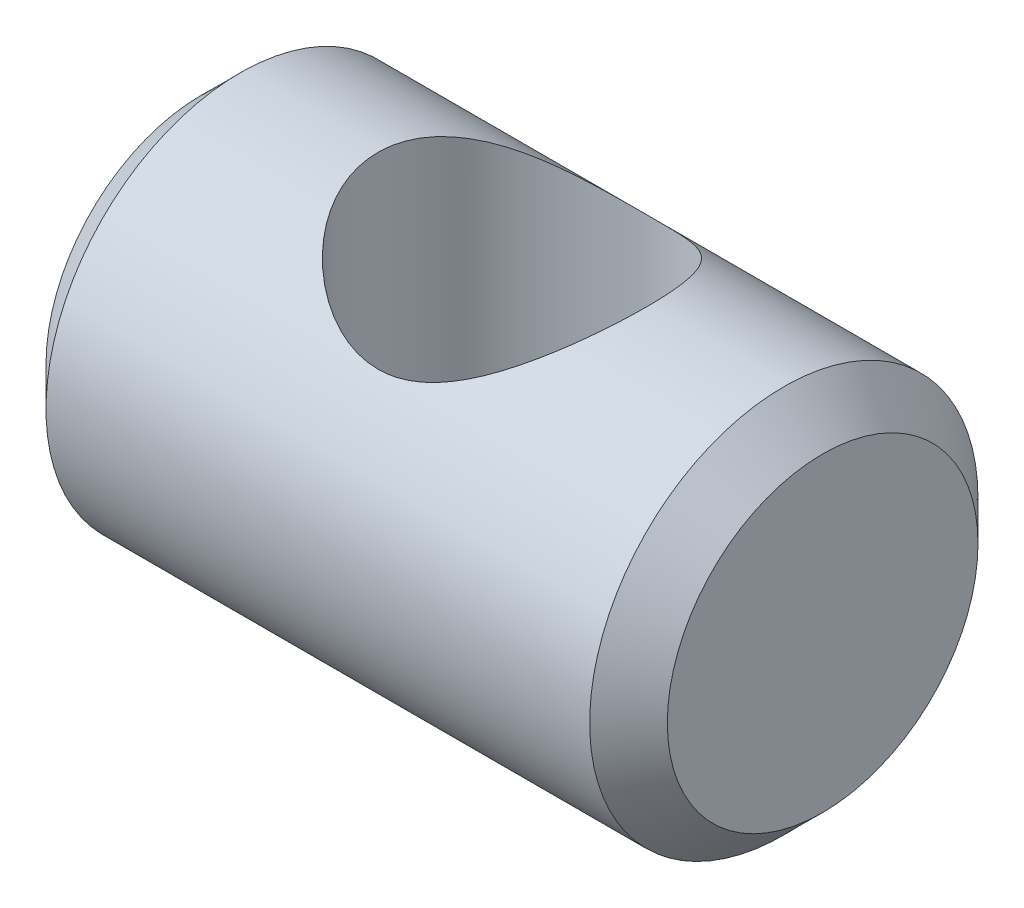
ISO-10303-21;
HEADER;
FILE_DESCRIPTION(('STEP AP214'),'2;1');
FILE_NAME('part.step','',(''),(''),'','','');
FILE_SCHEMA(('AUTOMOTIVE_DESIGN { 1 0 10303 214 1 1 1 1 }'));
ENDSEC;
DATA;
#1=APPLICATION_CONTEXT('core data for automotive mechanical design processes');
#2=APPLICATION_PROTOCOL_DEFINITION('international standard','automotive_design',2000,#1);
#3=PRODUCT_CONTEXT('',#1,'mechanical');
#4=PRODUCT('Part','Part','',(#3));
#5=PRODUCT_RELATED_PRODUCT_CATEGORY('part','',(#4));
#6=PRODUCT_DEFINITION_FORMATION('','',#4);
#7=PRODUCT_DEFINITION_CONTEXT('part definition',#1,'design');
#8=PRODUCT_DEFINITION('design','',#6,#7);
#9=PRODUCT_DEFINITION_SHAPE('','',#8);
#10=(LENGTH_UNIT() NAMED_UNIT(*) SI_UNIT(.MILLI.,.METRE.));
#11=(NAMED_UNIT(*) PLANE_ANGLE_UNIT() SI_UNIT($,.RADIAN.));
#12=(NAMED_UNIT(*) SI_UNIT($,.STERADIAN.) SOLID_ANGLE_UNIT());
#13=UNCERTAINTY_MEASURE_WITH_UNIT(LENGTH_MEASURE(1.E-05),#10,'distance_accuracy_value','');
#14=(GEOMETRIC_REPRESENTATION_CONTEXT(3) GLOBAL_UNCERTAINTY_ASSIGNED_CONTEXT((#13)) GLOBAL_UNIT_ASSIGNED_CONTEXT((#10,
#11,#12)) REPRESENTATION_CONTEXT('',''));
#15=CARTESIAN_POINT('',(0.,0.,0.));
#16=DIRECTION('',(0.,0.,1.));
#17=DIRECTION('',(1.,0.,0.));
#18=AXIS2_PLACEMENT_3D('',#15,#16,#17);
#19=CARTESIAN_POINT('',(16.,0.,0.));
#20=DIRECTION('',(-1.,0.,0.));
#21=DIRECTION('',(0.,0.,1.));
#22=AXIS2_PLACEMENT_3D('',#19,#20,#21);
#23=CYLINDRICAL_SURFACE('',#22,5.);
#24=CARTESIAN_POINT('',(15.,0.,0.));
#25=DIRECTION('',(1.,0.,0.));
#26=DIRECTION('',(0.,0.,-1.));
#27=AXIS2_PLACEMENT_3D('',#24,#25,#26);
#28=CIRCLE('',#27,5.);
#29=CARTESIAN_POINT('',(15.,0.,-5.));
#30=VERTEX_POINT('',#29);
#31=EDGE_CURVE('E37',#30,#30,#28,.F.);
#32=ORIENTED_EDGE('',*,*,#31,.T.);
#33=EDGE_LOOP('',(#32));
#34=FACE_BOUND('',#33,.T.);
#35=CARTESIAN_POINT('',(1.,0.,0.));
#36=DIRECTION('',(1.,0.,0.));
#37=DIRECTION('',(0.,0.,-1.));
#38=AXIS2_PLACEMENT_3D('',#35,#36,#37);
#39=CIRCLE('',#38,5.);
#40=CARTESIAN_POINT('',(1.,0.,-5.));
#41=VERTEX_POINT('',#40);
#42=EDGE_CURVE('E41',#41,#41,#39,.T.);
#43=ORIENTED_EDGE('',*,*,#42,.T.);
#44=EDGE_LOOP('',(#43));
#45=FACE_BOUND('',#44,.T.);
#46=CARTESIAN_POINT('',(4.54682791888593,-5.,0.));
#47=CARTESIAN_POINT('',(4.54682910075321,-4.99999918173203,0.172196156763363));
#48=CARTESIAN_POINT('',(4.55978100499834,-4.99102800434398,0.344395773395106));
#49=CARTESIAN_POINT('',(4.61075983223032,-4.95602798109568,0.68326042610615));
#50=CARTESIAN_POINT('',(4.64879831983937,-4.92999126825687,0.849922872377932));
#51=CARTESIAN_POINT('',(4.74754806789461,-4.86340708269305,1.17229101759618));
#52=CARTESIAN_POINT('',(4.808149374581,-4.82293002042624,1.32804556974799));
#53=CARTESIAN_POINT('',(4.94937572106752,-4.73065063001291,1.62645891734977));
#54=CARTESIAN_POINT('',(5.03000349860223,-4.67884675354127,1.76911591863361));
#55=CARTESIAN_POINT('',(5.21659138432099,-4.56258393251878,2.05137144263456));
#56=CARTESIAN_POINT('',(5.3241498043908,-4.49741460037626,2.18961252705359));
#57=CARTESIAN_POINT('',(5.55766675039381,-4.362507069895,2.44738952544475));
#58=CARTESIAN_POINT('',(5.68365252315353,-4.29276219182179,2.56689718835483));
#59=CARTESIAN_POINT('',(5.89656564603979,-4.18276590630911,2.74048294845699));
#60=CARTESIAN_POINT('',(5.97806259741498,-4.14226128170108,2.80116208806396));
#61=CARTESIAN_POINT('',(6.14655740095954,-4.06267506585551,2.91539452746007));
#62=CARTESIAN_POINT('',(6.23355662296743,-4.02359383283037,2.96894604238101));
#63=CARTESIAN_POINT('',(6.50233684993619,-3.91052346803921,3.11821884468568));
#64=CARTESIAN_POINT('',(6.69232694472034,-3.84047452644748,3.20290853298079));
#65=CARTESIAN_POINT('',(7.02988969071285,-3.74156128666144,3.31732275869861));
#66=CARTESIAN_POINT('',(7.17270531043151,-3.70665241177153,3.35593432460569));
#67=CARTESIAN_POINT('',(7.46489688766408,-3.65259603164848,3.41469801232633));
#68=CARTESIAN_POINT('',(7.61425991736806,-3.63341882113983,3.43488493258815));
#69=CARTESIAN_POINT('',(7.91641624346604,-3.61383411616895,3.45549424599109));
#70=CARTESIAN_POINT('',(8.06922336091824,-3.61352496987331,3.45581307861028));
#71=CARTESIAN_POINT('',(8.37242610912296,-3.63198843395806,3.4363952377521));
#72=CARTESIAN_POINT('',(8.5228199519425,-3.65077458344742,3.41664433426286));
#73=CARTESIAN_POINT('',(8.80808441498534,-3.70270455334308,3.36025439654469));
#74=CARTESIAN_POINT('',(8.94334631702183,-3.73492815822436,3.32468946423209));
#75=CARTESIAN_POINT('',(9.20601296782771,-3.80974914481309,3.2386819553798));
#76=CARTESIAN_POINT('',(9.33341143209238,-3.85235469265914,3.18822766066863));
#77=CARTESIAN_POINT('',(9.64228527811696,-3.96772920020722,3.04456027323595));
#78=CARTESIAN_POINT('',(9.81814384433062,-4.044789322983,2.94267022748984));
#79=CARTESIAN_POINT('',(10.1483447489459,-4.20357063829562,2.71105051300113));
#80=CARTESIAN_POINT('',(10.302644106179,-4.28530069675294,2.5812665047087));
#81=CARTESIAN_POINT('',(10.5889379099589,-4.4456777450186,2.29418410838496));
#82=CARTESIAN_POINT('',(10.720687157563,-4.52428447886163,2.1366169796621));
#83=CARTESIAN_POINT('',(10.955952052221,-4.66955274733486,1.79700191774292));
#84=CARTESIAN_POINT('',(11.0595262415596,-4.73623895004106,1.61500593718904));
#85=CARTESIAN_POINT('',(11.2141846574899,-4.83776906567046,1.2729562406956));
#86=CARTESIAN_POINT('',(11.271815159077,-4.87639473281822,1.11698331299041));
#87=CARTESIAN_POINT('',(11.364413143489,-4.93899809765687,0.795623202532488));
#88=CARTESIAN_POINT('',(11.3993960195488,-4.96298574394239,0.63024249744415));
#89=CARTESIAN_POINT('',(11.444837263291,-4.99421966305794,0.293911581629637));
#90=CARTESIAN_POINT('',(11.4552042398488,-5.00140354731808,0.12294299772574));
#91=CARTESIAN_POINT('',(11.450479145441,-4.99814010880797,-0.218476600652292));
#92=CARTESIAN_POINT('',(11.4353870151718,-4.987692744968,-0.388927613919888));
#93=CARTESIAN_POINT('',(11.3823442556729,-4.95131460901015,-0.713899211129431));
#94=CARTESIAN_POINT('',(11.3458058465487,-4.92634121043672,-0.868764443819995));
#95=CARTESIAN_POINT('',(11.2528643880156,-4.86369756264659,-1.16965181165549));
#96=CARTESIAN_POINT('',(11.1964576598131,-4.82602496211675,-1.31567230324688));
#97=CARTESIAN_POINT('',(11.0610158444308,-4.73736199680481,-1.60695565285634));
#98=CARTESIAN_POINT('',(10.9805922110018,-4.68557999877782,-1.75132630627568));
#99=CARTESIAN_POINT('',(10.8018312404334,-4.57394651645061,-2.02506996094344));
#100=CARTESIAN_POINT('',(10.7034815076101,-4.51408945582995,-2.15443248231643));
#101=CARTESIAN_POINT('',(10.4728682535481,-4.37954752405462,-2.4176292036336));
#102=CARTESIAN_POINT('',(10.3376818696958,-4.30406990980382,-2.54849852636715));
#103=CARTESIAN_POINT('',(10.0476429784116,-4.15367708917197,-2.78690358547467));
#104=CARTESIAN_POINT('',(9.89277820388263,-4.07876226474206,-2.89442465279582));
#105=CARTESIAN_POINT('',(9.58406686339841,-3.9456102896562,-3.07295651612266));
#106=CARTESIAN_POINT('',(9.43225290109357,-3.8864481871076,-3.14677727569369));
#107=CARTESIAN_POINT('',(9.11557716679436,-3.78126645263767,-3.27242454966351));
#108=CARTESIAN_POINT('',(8.95074181776842,-3.7352210370572,-3.32429431234346));
#109=CARTESIAN_POINT('',(8.6421679208131,-3.67010269185821,-3.3959188314815));
#110=CARTESIAN_POINT('',(8.50013126981503,-3.64762496769666,-3.41982764767191));
#111=CARTESIAN_POINT('',(8.21259033523534,-3.61945024972117,-3.44964232562668));
#112=CARTESIAN_POINT('',(8.06709005137103,-3.61373476474713,-3.45556802560528));
#113=CARTESIAN_POINT('',(7.7768615859174,-3.61998913038536,-3.44901296118591));
#114=CARTESIAN_POINT('',(7.63213367572215,-3.63196483316938,-3.43652610599332));
#115=CARTESIAN_POINT('',(7.34743885431317,-3.671711108667,-3.39401689131554));
#116=CARTESIAN_POINT('',(7.20747911724666,-3.69950445655522,-3.36396924508931));
#117=CARTESIAN_POINT('',(6.8940263684569,-3.77746578569453,-3.2764474920316));
#118=CARTESIAN_POINT('',(6.72315074489304,-3.83185379433592,-3.21343478869826));
#119=CARTESIAN_POINT('',(6.39673440636893,-3.95258397909083,-3.0637085483484));
#120=CARTESIAN_POINT('',(6.24121766601841,-4.01894440115507,-2.976958730255));
#121=CARTESIAN_POINT('',(5.9433916911072,-4.1578281301539,-2.77981111505691));
#122=CARTESIAN_POINT('',(5.80145269670578,-4.23045561018461,-2.66893070413724));
#123=CARTESIAN_POINT('',(5.53597770124776,-4.37430851302554,-2.42597207923423));
#124=CARTESIAN_POINT('',(5.41244768168111,-4.44553347363009,-2.29388700421073));
#125=CARTESIAN_POINT('',(5.23386917843982,-4.55240155427666,-2.06977124704514));
#126=CARTESIAN_POINT('',(5.1718894438513,-4.59039728850961,-1.98429835082973));
#127=CARTESIAN_POINT('',(5.05547329358905,-4.66302106813397,-1.80704029505651));
#128=CARTESIAN_POINT('',(5.00103333702178,-4.69765069205234,-1.71525812902221));
#129=CARTESIAN_POINT('',(4.90040623644659,-4.76252106040801,-1.52590685251927));
#130=CARTESIAN_POINT('',(4.85421105176081,-4.7927660754502,-1.42834350521688));
#131=CARTESIAN_POINT('',(4.77076140614659,-4.84794896402373,-1.22808520925869));
#132=CARTESIAN_POINT('',(4.73350361926001,-4.8728888114247,-1.12539218680046));
#133=CARTESIAN_POINT('',(4.65069511903616,-4.92869476707882,-0.857632329920141));
#134=CARTESIAN_POINT('',(4.61193556944714,-4.9552221998418,-0.689451392223377));
#135=CARTESIAN_POINT('',(4.56001218356368,-4.99086787634293,-0.347511585256502));
#136=CARTESIAN_POINT('',(4.546826726302,-5.00000082568765,-0.173757554077207));
#137=CARTESIAN_POINT('',(4.54682791888593,-5.,0.));
#138=B_SPLINE_CURVE_WITH_KNOTS('',3,(#46,#47,#48,#49,#50,#51,#52,#53,#54,#55,#56,#57,#58,#59,
#60,#61,#62,#63,#64,#65,#66,#67,#68,#69,#70,#71,#72,#73,#74,#75,#76,#77,#78,#79,#80,#81,#82,#83,
#84,#85,#86,#87,#88,#89,#90,#91,#92,#93,#94,#95,#96,#97,#98,#99,#100,#101,#102,#103,#104,#105,
#106,#107,#108,#109,#110,#111,#112,#113,#114,#115,#116,#117,#118,#119,#120,#121,#122,#123,#124,
#125,#126,#127,#128,#129,#130,#131,#132,#133,#134,#135,#136,#137),.UNSPECIFIED.,.T.,.F.,(4,2,2,
2,2,2,2,2,2,2,2,2,2,2,2,2,2,2,2,2,2,2,2,2,2,2,2,2,2,2,2,2,2,2,2,2,2,2,2,2,2,2,2,2,2,4),(0.,
0.515904150983216,1.03204629415389,1.54570539797054,2.05943476064836,2.61807149521183,
3.17754274476324,3.50533179794281,3.83320278078806,4.48716881546518,4.94149267770683,
5.39495667647332,5.8507841166619,6.30693497709684,6.73596062923389,7.16532483616348,
7.81400221678349,8.46395491301902,9.12057887552444,9.77582789535008,10.2858068259602,
10.795438766985,11.3069598733689,11.8184821712765,12.2995956681031,12.7807982941843,
13.2983875888437,13.8163361575892,14.422158628214,15.028360625848,15.5630919786522,
16.0967648323793,16.5322008494351,16.9671563369361,17.4022557381363,17.8379832117704,
18.4051254734002,18.9731394750222,19.5537743623541,20.1345975015913,20.4708141758247,
20.8068724138473,21.1426011000412,21.4782046538526,21.9992274695231,22.5198096073481),.UNSPECIFIED.);
#139=CARTESIAN_POINT('',(4.54682791888593,-5.,0.));
#140=VERTEX_POINT('',#139);
#141=EDGE_CURVE('E50',#140,#140,#138,.T.);
#142=ORIENTED_EDGE('',*,*,#141,.T.);
#143=EDGE_LOOP('',(#142));
#144=FACE_BOUND('',#143,.T.);
#145=CARTESIAN_POINT('',(8.,3.6160202679485,3.45317208111407));
#146=CARTESIAN_POINT('',(7.91668999530245,3.61601110102939,3.45317713537138));
#147=CARTESIAN_POINT('',(7.83341436044414,3.61890880846796,3.4501536815529));
#148=CARTESIAN_POINT('',(7.66765640961408,3.63032154441814,3.43814504215448));
#149=CARTESIAN_POINT('',(7.58517425085987,3.63883766380207,3.42915869881641));
#150=CARTESIAN_POINT('',(7.42164025270491,3.66108204127706,3.40539851331557));
#151=CARTESIAN_POINT('',(7.3405908643512,3.6748184679887,3.39061559965051));
#152=CARTESIAN_POINT('',(7.180598320214,3.70686777138745,3.35554688490185));
#153=CARTESIAN_POINT('',(7.10165631921745,3.72518310243223,3.33525813211023));
#154=CARTESIAN_POINT('',(6.87042209971612,3.7854447496548,3.26711689715834));
#155=CARTESIAN_POINT('',(6.72176135513656,3.83300470488468,3.21169222893622));
#156=CARTESIAN_POINT('',(6.43625356593956,3.93740644786877,3.08280620332772));
#157=CARTESIAN_POINT('',(6.29940789483783,3.99424931255676,3.00934275271808));
#158=CARTESIAN_POINT('',(6.01591553457581,4.12233007111759,2.83201235766588));
#159=CARTESIAN_POINT('',(5.87153587500692,4.19437525314578,2.72510314230678));
#160=CARTESIAN_POINT('',(5.60069571131038,4.33809784369231,2.48996184894861));
#161=CARTESIAN_POINT('',(5.4742566385771,4.40977471539496,2.36170465988116));
#162=CARTESIAN_POINT('',(5.29041521033473,4.51824174888274,2.14325590333096));
#163=CARTESIAN_POINT('',(5.22629075628646,4.55706133551027,2.0596440483324));
#164=CARTESIAN_POINT('',(5.10541455757851,4.63162600092784,1.88598961976921));
#165=CARTESIAN_POINT('',(5.0486595093824,4.66737245488781,1.79594995589417));
#166=CARTESIAN_POINT('',(4.94322453724054,4.73474792384596,1.60994675612301));
#167=CARTESIAN_POINT('',(4.89453450672623,4.76638208124443,1.51399084432569));
#168=CARTESIAN_POINT('',(4.80589007499087,4.82460643720123,1.31672271046611));
#169=CARTESIAN_POINT('',(4.76593200753623,4.85119875202254,1.21541275864404));
#170=CARTESIAN_POINT('',(4.67881318183096,4.90962140079808,0.959180589431557));
#171=CARTESIAN_POINT('',(4.63715354584004,4.93800053542577,0.80152193111207));
#172=CARTESIAN_POINT('',(4.57645372694371,4.97953628392576,0.480064373898841));
#173=CARTESIAN_POINT('',(4.5573957760523,4.99270485514888,0.316270402836387));
#174=CARTESIAN_POINT('',(4.54291365823344,5.00270109985476,-0.0131865530433853));
#175=CARTESIAN_POINT('',(4.54753272043397,4.99949888383311,-0.178852405097388));
#176=CARTESIAN_POINT('',(4.58023633119844,4.97697186107739,-0.506736022372955));
#177=CARTESIAN_POINT('',(4.6083275878099,4.95764244540198,-0.668952788299139));
#178=CARTESIAN_POINT('',(4.68559987515033,4.90510659228885,-0.982165388445185));
#179=CARTESIAN_POINT('',(4.73433008391627,4.87219716041332,-1.13332443683614));
#180=CARTESIAN_POINT('',(4.85065447802043,4.79500685030528,-1.4250278898192));
#181=CARTESIAN_POINT('',(4.91825230295993,4.75072377820628,-1.56557023977566));
#182=CARTESIAN_POINT('',(5.07865424052564,4.64818546659489,-1.84921562721286));
#183=CARTESIAN_POINT('',(5.17343892132361,4.58891865720852,-1.99082685183754));
#184=CARTESIAN_POINT('',(5.38109513441154,4.46400957978206,-2.25705384691499));
#185=CARTESIAN_POINT('',(5.49398681801501,4.39836024105407,-2.38165039229081));
#186=CARTESIAN_POINT('',(5.757100237581,4.25347479839561,-2.63295626256513));
#187=CARTESIAN_POINT('',(5.9103985139408,4.173866724347,-2.75624079671781));
#188=CARTESIAN_POINT('',(6.23761307204616,4.02004717812529,-2.97610383501427));
#189=CARTESIAN_POINT('',(6.41152129956312,3.94583361598661,-3.07269272278503));
#190=CARTESIAN_POINT('',(6.7352926348354,3.82857655459006,-3.21691275151425));
#191=CARTESIAN_POINT('',(6.88122891813934,3.78230483380808,-3.27071317346371));
#192=CARTESIAN_POINT('',(7.18266094672693,3.70441220426919,-3.35869613388319));
#193=CARTESIAN_POINT('',(7.3381382961999,3.67276404698872,-3.39291518751473));
#194=CARTESIAN_POINT('',(7.57644901905259,3.6398709839845,-3.42805727631623));
#195=CARTESIAN_POINT('',(7.65717182951374,3.63133075888234,-3.43707750290734));
#196=CARTESIAN_POINT('',(7.81942541857755,3.61962509180995,-3.44940485459584));
#197=CARTESIAN_POINT('',(7.90095579381123,3.61645709042855,-3.45271470022085));
#198=CARTESIAN_POINT('',(8.06407932977235,3.61566796761627,-3.45354095278969));
#199=CARTESIAN_POINT('',(8.14567249516098,3.61804730791127,-3.45105687748392));
#200=CARTESIAN_POINT('',(8.30811936988585,3.6282163761755,-3.44036261561005));
#201=CARTESIAN_POINT('',(8.38897310276153,3.63600593130177,-3.43215261197112));
#202=CARTESIAN_POINT('',(8.60894710704228,3.66432429843713,-3.40197713159878));
#203=CARTESIAN_POINT('',(8.74667307972105,3.69001911729673,-3.37432238486495));
#204=CARTESIAN_POINT('',(9.01509126642746,3.75351658149827,-3.30353477407692));
#205=CARTESIAN_POINT('',(9.14577637368745,3.79133120220234,-3.26038659614122));
#206=CARTESIAN_POINT('',(9.45750627868782,3.89478599018298,-3.13683857738241));
#207=CARTESIAN_POINT('',(9.63380926671075,3.96519866558128,-3.04844252773488));
#208=CARTESIAN_POINT('',(9.96687340572278,4.11362091112507,-2.84500081118571));
#209=CARTESIAN_POINT('',(10.1235962533971,4.19164485595066,-2.72990412974317));
#210=CARTESIAN_POINT('',(10.4183041538611,4.34833566506337,-2.47285855509405));
#211=CARTESIAN_POINT('',(10.5559351330704,4.42699171457706,-2.3304957854929));
#212=CARTESIAN_POINT('',(10.806385833011,4.57616864208442,-2.02187182707863));
#213=CARTESIAN_POINT('',(10.9192432429404,4.64670179899771,-1.85564758614276));
#214=CARTESIAN_POINT('',(11.0995235985726,4.76221900135061,-1.53156414472163));
#215=CARTESIAN_POINT('',(11.1713973260605,4.80950532053234,-1.37701073946563));
#216=CARTESIAN_POINT('',(11.292296096661,4.89006905103756,-1.05573608113012));
#217=CARTESIAN_POINT('',(11.3413354211878,4.92335521727054,-0.889022509112773));
#218=CARTESIAN_POINT('',(11.4141297735222,4.97304413971203,-0.546693435840831));
#219=CARTESIAN_POINT('',(11.4377494642555,4.98935651037543,-0.371035450400311));
#220=CARTESIAN_POINT('',(11.4576599155155,5.00309468203387,-0.0174477445768937));
#221=CARTESIAN_POINT('',(11.4539590870438,5.00052629573341,0.16048125980249));
#222=CARTESIAN_POINT('',(11.4210775558008,4.97787712633069,0.496559086156381));
#223=CARTESIAN_POINT('',(11.3942082999467,4.95938520672623,0.655052353257812));
#224=CARTESIAN_POINT('',(11.3195152611459,4.9085676898121,0.964671585554634));
#225=CARTESIAN_POINT('',(11.2716872880161,4.87623932627396,1.1157960708249));
#226=CARTESIAN_POINT('',(11.1547505543736,4.7985480252421,1.41373588989151));
#227=CARTESIAN_POINT('',(11.084828191758,4.75269216597425,1.56009952936073));
#228=CARTESIAN_POINT('',(10.926999489116,4.65180050423436,1.83924123534357));
#229=CARTESIAN_POINT('',(10.8390893108508,4.5967627429924,1.97201639326191));
#230=CARTESIAN_POINT('',(10.6323383439532,4.47179714026261,2.24244577062297));
#231=CARTESIAN_POINT('',(10.5108075155311,4.40088878756535,2.37758395202277));
#232=CARTESIAN_POINT('',(10.2485624471605,4.25670975605049,2.62701268091245));
#233=CARTESIAN_POINT('',(10.1078065594151,4.18343421973873,2.74125667216879));
#234=CARTESIAN_POINT('',(9.87265369505729,4.0714602174917,2.90316792112241));
#235=CARTESIAN_POINT('',(9.78408467841533,4.03134218487988,2.95845049860932));
#236=CARTESIAN_POINT('',(9.60131889560586,3.95385459871085,3.06123656378086));
#237=CARTESIAN_POINT('',(9.50712050698219,3.91648584452154,3.10873779388136));
#238=CARTESIAN_POINT('',(9.31368583817821,3.84620432170434,3.19528008227813));
#239=CARTESIAN_POINT('',(9.21446605081371,3.81327812110067,3.23434686719413));
#240=CARTESIAN_POINT('',(9.01125373050832,3.75350711785883,3.30352443398183));
#241=CARTESIAN_POINT('',(8.90726508504655,3.7266574641068,3.33364236608026));
#242=CARTESIAN_POINT('',(8.67192616447165,3.67575811357513,3.38977252141077));
#243=CARTESIAN_POINT('',(8.53957701467589,3.65361407972272,3.41343548196672));
#244=CARTESIAN_POINT('',(8.27145230208193,3.62376035553127,3.44512276673657));
#245=CARTESIAN_POINT('',(8.13568056955248,3.61603519740157,3.45316384963559));
#246=CARTESIAN_POINT('',(8.,3.6160202679485,3.45317208111407));
#247=B_SPLINE_CURVE_WITH_KNOTS('',3,(#145,#146,#147,#148,#149,#150,#151,#152,#153,#154,#155,
#156,#157,#158,#159,#160,#161,#162,#163,#164,#165,#166,#167,#168,#169,#170,#171,#172,#173,#174,
#175,#176,#177,#178,#179,#180,#181,#182,#183,#184,#185,#186,#187,#188,#189,#190,#191,#192,#193,
#194,#195,#196,#197,#198,#199,#200,#201,#202,#203,#204,#205,#206,#207,#208,#209,#210,#211,#212,
#213,#214,#215,#216,#217,#218,#219,#220,#221,#222,#223,#224,#225,#226,#227,#228,#229,#230,#231,
#232,#233,#234,#235,#236,#237,#238,#239,#240,#241,#242,#243,#244,#245,#246),.UNSPECIFIED.,.T.,
.F.,(4,2,2,2,2,2,2,2,2,2,2,2,2,2,2,2,2,2,2,2,2,2,2,2,2,2,2,2,2,2,2,2,2,2,2,2,2,2,2,2,2,2,2,2,2,
2,2,2,2,2,4),(0.,0.249767573816079,0.499583656846901,0.749792266889152,1.00013528092545,
1.49488446178391,1.98969108057193,2.56832266904088,3.14763976019936,3.48412080734436,
3.82045049310645,4.15635546993077,4.49211914034302,4.98634977609292,5.48019162152295,
5.9749354366303,6.46982069145693,6.95441230496626,7.43909746185856,7.97832889304035,
8.51816465372637,9.15219490152499,9.78597818663592,10.2711156240621,10.755345408383,
11.0000394644804,11.2446169117284,11.489214716794,11.7338047079257,12.1603268756465,
12.5872717884064,13.2121548185711,13.8382417364025,14.4747175032041,15.1102181532934,
15.638692648042,16.1668361713885,16.6977778890828,17.2285561558074,17.7118022850398,
18.1951450716282,18.6989052992013,19.2027731314008,19.7858750608016,20.3702608306825,
20.705436019934,21.0407082812096,21.374942981441,21.7089099020422,22.1161241458309,
22.5229013005573),.UNSPECIFIED.);
#248=CARTESIAN_POINT('',(8.,3.6160202679485,3.45317208111407));
#249=VERTEX_POINT('',#248);
#250=EDGE_CURVE('E57',#249,#249,#247,.T.);
#251=ORIENTED_EDGE('',*,*,#250,.T.);
#252=EDGE_LOOP('',(#251));
#253=FACE_BOUND('',#252,.T.);
#254=ADVANCED_FACE('F30',(#34,#45,#144,#253),#23,.T.);
#255=CARTESIAN_POINT('',(16.,0.,0.));
#256=DIRECTION('',(1.,0.,0.));
#257=DIRECTION('',(0.,0.,-1.));
#258=AXIS2_PLACEMENT_3D('',#255,#256,#257);
#259=PLANE('',#258);
#260=CARTESIAN_POINT('',(16.,0.,0.));
#261=DIRECTION('',(1.,0.,0.));
#262=DIRECTION('',(0.,0.,-1.));
#263=AXIS2_PLACEMENT_3D('',#260,#261,#262);
#264=CIRCLE('',#263,4.);
#265=CARTESIAN_POINT('',(16.,0.,-4.));
#266=VERTEX_POINT('',#265);
#267=EDGE_CURVE('E45',#266,#266,#264,.T.);
#268=ORIENTED_EDGE('',*,*,#267,.T.);
#269=EDGE_LOOP('',(#268));
#270=FACE_BOUND('',#269,.T.);
#271=ADVANCED_FACE('F69',(#270),#259,.T.);
#272=CARTESIAN_POINT('',(0.,0.,0.));
#273=DIRECTION('',(1.,0.,0.));
#274=DIRECTION('',(0.,0.,-1.));
#275=AXIS2_PLACEMENT_3D('',#272,#273,#274);
#276=PLANE('',#275);
#277=CARTESIAN_POINT('',(0.,0.,0.));
#278=DIRECTION('',(1.,0.,0.));
#279=DIRECTION('',(0.,0.,-1.));
#280=AXIS2_PLACEMENT_3D('',#277,#278,#279);
#281=CIRCLE('',#280,4.);
#282=CARTESIAN_POINT('',(0.,0.,-4.));
#283=VERTEX_POINT('',#282);
#284=EDGE_CURVE('E10',#283,#283,#281,.F.);
#285=ORIENTED_EDGE('',*,*,#284,.T.);
#286=EDGE_LOOP('',(#285));
#287=FACE_BOUND('',#286,.T.);
#288=ADVANCED_FACE('F67',(#287),#276,.F.);
#289=CARTESIAN_POINT('',(8.,-5.,0.));
#290=DIRECTION('',(0.,1.,0.));
#291=DIRECTION('',(0.,0.,1.));
#292=AXIS2_PLACEMENT_3D('',#289,#290,#291);
#293=CYLINDRICAL_SURFACE('',#292,3.45317208111407);
#294=ORIENTED_EDGE('',*,*,#250,.F.);
#295=EDGE_LOOP('',(#294));
#296=FACE_BOUND('',#295,.T.);
#297=ORIENTED_EDGE('',*,*,#141,.F.);
#298=EDGE_LOOP('',(#297));
#299=FACE_BOUND('',#298,.T.);
#300=ADVANCED_FACE('F62',(#296,#299),#293,.F.);
#301=CARTESIAN_POINT('',(16.,0.,0.));
#302=DIRECTION('',(-1.,0.,0.));
#303=DIRECTION('',(0.,0.,1.));
#304=AXIS2_PLACEMENT_3D('',#301,#302,#303);
#305=CONICAL_SURFACE('',#304,4.,0.785398163397446);
#306=ORIENTED_EDGE('',*,*,#31,.F.);
#307=EDGE_LOOP('',(#306));
#308=FACE_BOUND('',#307,.T.);
#309=ORIENTED_EDGE('',*,*,#267,.F.);
#310=EDGE_LOOP('',(#309));
#311=FACE_BOUND('',#310,.T.);
#312=ADVANCED_FACE('F66',(#308,#311),#305,.T.);
#313=CARTESIAN_POINT('',(1.,0.,0.));
#314=DIRECTION('',(1.,0.,0.));
#315=DIRECTION('',(0.,0.,-1.));
#316=AXIS2_PLACEMENT_3D('',#313,#314,#315);
#317=CONICAL_SURFACE('',#316,5.,0.78539816339745);
#318=ORIENTED_EDGE('',*,*,#284,.F.);
#319=EDGE_LOOP('',(#318));
#320=FACE_BOUND('',#319,.T.);
#321=ORIENTED_EDGE('',*,*,#42,.F.);
#322=EDGE_LOOP('',(#321));
#323=FACE_BOUND('',#322,.T.);
#324=ADVANCED_FACE('F32',(#320,#323),#317,.T.);
#325=CLOSED_SHELL('',(#254,#271,#288,#300,#312,#324));
#326=MANIFOLD_SOLID_BREP('B2',#325);
#327=ADVANCED_BREP_SHAPE_REPRESENTATION('',(#18,#326),#14);
#328=SHAPE_DEFINITION_REPRESENTATION(#9,#327);
ENDSEC;
END-ISO-10303-21;
